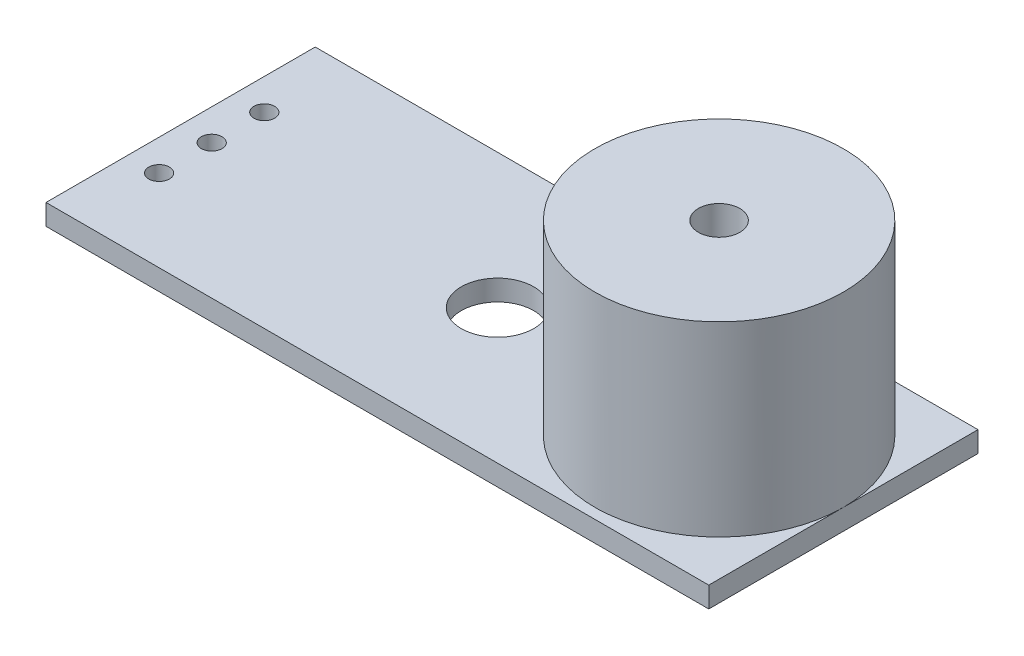
ISO-10303-21;
HEADER;
FILE_DESCRIPTION(('STEP AP214'),'2;1');
FILE_NAME('part.step','',(''),(''),'','','');
FILE_SCHEMA(('AUTOMOTIVE_DESIGN { 1 0 10303 214 1 1 1 1 }'));
ENDSEC;
DATA;
#1=APPLICATION_CONTEXT('core data for automotive mechanical design processes');
#2=APPLICATION_PROTOCOL_DEFINITION('international standard','automotive_design',2000,#1);
#3=PRODUCT_CONTEXT('',#1,'mechanical');
#4=PRODUCT('Part','Part','',(#3));
#5=PRODUCT_RELATED_PRODUCT_CATEGORY('part','',(#4));
#6=PRODUCT_DEFINITION_FORMATION('','',#4);
#7=PRODUCT_DEFINITION_CONTEXT('part definition',#1,'design');
#8=PRODUCT_DEFINITION('design','',#6,#7);
#9=PRODUCT_DEFINITION_SHAPE('','',#8);
#10=(LENGTH_UNIT() NAMED_UNIT(*) SI_UNIT(.MILLI.,.METRE.));
#11=(NAMED_UNIT(*) PLANE_ANGLE_UNIT() SI_UNIT($,.RADIAN.));
#12=(NAMED_UNIT(*) SI_UNIT($,.STERADIAN.) SOLID_ANGLE_UNIT());
#13=UNCERTAINTY_MEASURE_WITH_UNIT(LENGTH_MEASURE(1.E-05),#10,'distance_accuracy_value','');
#14=(GEOMETRIC_REPRESENTATION_CONTEXT(3) GLOBAL_UNCERTAINTY_ASSIGNED_CONTEXT((#13)) GLOBAL_UNIT_ASSIGNED_CONTEXT((#10,
#11,#12)) REPRESENTATION_CONTEXT('',''));
#15=CARTESIAN_POINT('',(0.,0.,0.));
#16=DIRECTION('',(0.,0.,1.));
#17=DIRECTION('',(1.,0.,0.));
#18=AXIS2_PLACEMENT_3D('',#15,#16,#17);
#19=CARTESIAN_POINT('',(16.,1.,-6.5));
#20=DIRECTION('',(-1.,0.,0.));
#21=DIRECTION('',(0.,0.,1.));
#22=AXIS2_PLACEMENT_3D('',#19,#20,#21);
#23=PLANE('',#22);
#24=DIRECTION('',(0.,0.,-1.));
#25=VECTOR('',#24,1.);
#26=CARTESIAN_POINT('',(16.,0.,-6.5));
#27=LINE('',#26,#25);
#28=CARTESIAN_POINT('',(16.,0.,6.5));
#29=VERTEX_POINT('',#28);
#30=CARTESIAN_POINT('',(16.,0.,-6.5));
#31=VERTEX_POINT('',#30);
#32=EDGE_CURVE('E108',#29,#31,#27,.T.);
#33=ORIENTED_EDGE('',*,*,#32,.T.);
#34=DIRECTION('',(0.,-1.,0.));
#35=VECTOR('',#34,1.);
#36=CARTESIAN_POINT('',(16.,1.,-6.5));
#37=LINE('',#36,#35);
#38=CARTESIAN_POINT('',(16.,1.,-6.5));
#39=VERTEX_POINT('',#38);
#40=EDGE_CURVE('E11',#39,#31,#37,.T.);
#41=ORIENTED_EDGE('',*,*,#40,.F.);
#42=DIRECTION('',(0.,0.,-1.));
#43=VECTOR('',#42,1.);
#44=CARTESIAN_POINT('',(16.,1.,-6.5));
#45=LINE('',#44,#43);
#46=CARTESIAN_POINT('',(16.,0.999999999999999,0.));
#47=VERTEX_POINT('',#46);
#48=EDGE_CURVE('E83',#47,#39,#45,.T.);
#49=ORIENTED_EDGE('',*,*,#48,.F.);
#50=CARTESIAN_POINT('',(16.,1.,6.5));
#51=VERTEX_POINT('',#50);
#52=EDGE_CURVE('E93',#51,#47,#45,.T.);
#53=ORIENTED_EDGE('',*,*,#52,.F.);
#54=DIRECTION('',(0.,-1.,0.));
#55=VECTOR('',#54,1.);
#56=CARTESIAN_POINT('',(16.,1.,6.5));
#57=LINE('',#56,#55);
#58=EDGE_CURVE('E104',#51,#29,#57,.T.);
#59=ORIENTED_EDGE('',*,*,#58,.T.);
#60=EDGE_LOOP('',(#33,#41,#49,#53,#59));
#61=FACE_BOUND('',#60,.T.);
#62=ADVANCED_FACE('F37',(#61),#23,.F.);
#63=CARTESIAN_POINT('',(-16.,1.,-6.5));
#64=DIRECTION('',(0.,0.,1.));
#65=DIRECTION('',(1.,0.,0.));
#66=AXIS2_PLACEMENT_3D('',#63,#64,#65);
#67=PLANE('',#66);
#68=DIRECTION('',(-1.,0.,0.));
#69=VECTOR('',#68,1.);
#70=CARTESIAN_POINT('',(-16.,0.,-6.5));
#71=LINE('',#70,#69);
#72=CARTESIAN_POINT('',(-16.,0.,-6.5));
#73=VERTEX_POINT('',#72);
#74=EDGE_CURVE('E98',#31,#73,#71,.T.);
#75=ORIENTED_EDGE('',*,*,#74,.T.);
#76=DIRECTION('',(0.,-1.,0.));
#77=VECTOR('',#76,1.);
#78=CARTESIAN_POINT('',(-16.,1.,-6.5));
#79=LINE('',#78,#77);
#80=CARTESIAN_POINT('',(-16.,1.,-6.5));
#81=VERTEX_POINT('',#80);
#82=EDGE_CURVE('E44',#81,#73,#79,.T.);
#83=ORIENTED_EDGE('',*,*,#82,.F.);
#84=DIRECTION('',(-1.,0.,0.));
#85=VECTOR('',#84,1.);
#86=CARTESIAN_POINT('',(-16.,1.,-6.5));
#87=LINE('',#86,#85);
#88=EDGE_CURVE('E85',#39,#81,#87,.T.);
#89=ORIENTED_EDGE('',*,*,#88,.F.);
#90=ORIENTED_EDGE('',*,*,#40,.T.);
#91=EDGE_LOOP('',(#75,#83,#89,#90));
#92=FACE_BOUND('',#91,.T.);
#93=ADVANCED_FACE('F96',(#92),#67,.F.);
#94=CARTESIAN_POINT('',(-16.,1.,-6.5));
#95=DIRECTION('',(1.,0.,0.));
#96=DIRECTION('',(0.,0.,-1.));
#97=AXIS2_PLACEMENT_3D('',#94,#95,#96);
#98=PLANE('',#97);
#99=DIRECTION('',(0.,0.,1.));
#100=VECTOR('',#99,1.);
#101=CARTESIAN_POINT('',(-16.,0.,-6.5));
#102=LINE('',#101,#100);
#103=CARTESIAN_POINT('',(-16.,0.,6.5));
#104=VERTEX_POINT('',#103);
#105=EDGE_CURVE('E112',#73,#104,#102,.T.);
#106=ORIENTED_EDGE('',*,*,#105,.T.);
#107=DIRECTION('',(0.,-1.,0.));
#108=VECTOR('',#107,1.);
#109=CARTESIAN_POINT('',(-16.,1.,6.5));
#110=LINE('',#109,#108);
#111=CARTESIAN_POINT('',(-16.,1.,6.5));
#112=VERTEX_POINT('',#111);
#113=EDGE_CURVE('E101',#112,#104,#110,.T.);
#114=ORIENTED_EDGE('',*,*,#113,.F.);
#115=DIRECTION('',(0.,0.,1.));
#116=VECTOR('',#115,1.);
#117=CARTESIAN_POINT('',(-16.,1.,-6.5));
#118=LINE('',#117,#116);
#119=EDGE_CURVE('E89',#81,#112,#118,.T.);
#120=ORIENTED_EDGE('',*,*,#119,.F.);
#121=ORIENTED_EDGE('',*,*,#82,.T.);
#122=EDGE_LOOP('',(#106,#114,#120,#121));
#123=FACE_BOUND('',#122,.T.);
#124=ADVANCED_FACE('F102',(#123),#98,.F.);
#125=CARTESIAN_POINT('',(-16.,1.,6.5));
#126=DIRECTION('',(0.,0.,-1.));
#127=DIRECTION('',(-1.,0.,0.));
#128=AXIS2_PLACEMENT_3D('',#125,#126,#127);
#129=PLANE('',#128);
#130=DIRECTION('',(1.,0.,0.));
#131=VECTOR('',#130,1.);
#132=CARTESIAN_POINT('',(-16.,0.,6.5));
#133=LINE('',#132,#131);
#134=EDGE_CURVE('E77',#104,#29,#133,.T.);
#135=ORIENTED_EDGE('',*,*,#134,.T.);
#136=ORIENTED_EDGE('',*,*,#58,.F.);
#137=DIRECTION('',(1.,0.,0.));
#138=VECTOR('',#137,1.);
#139=CARTESIAN_POINT('',(-16.,1.,6.5));
#140=LINE('',#139,#138);
#141=EDGE_CURVE('E57',#112,#51,#140,.T.);
#142=ORIENTED_EDGE('',*,*,#141,.F.);
#143=ORIENTED_EDGE('',*,*,#113,.T.);
#144=EDGE_LOOP('',(#135,#136,#142,#143));
#145=FACE_BOUND('',#144,.T.);
#146=ADVANCED_FACE('F116',(#145),#129,.F.);
#147=CARTESIAN_POINT('',(0.,1.,0.));
#148=DIRECTION('',(0.,1.,0.));
#149=DIRECTION('',(0.,0.,1.));
#150=AXIS2_PLACEMENT_3D('',#147,#148,#149);
#151=PLANE('',#150);
#152=CARTESIAN_POINT('',(-14.5,1.,-2.54));
#153=DIRECTION('',(0.,1.,0.));
#154=DIRECTION('',(0.,0.,1.));
#155=AXIS2_PLACEMENT_3D('',#152,#153,#154);
#156=CIRCLE('',#155,0.500000000000001);
#157=CARTESIAN_POINT('',(-14.5,1.,-2.04));
#158=VERTEX_POINT('',#157);
#159=EDGE_CURVE('E146',#158,#158,#156,.T.);
#160=ORIENTED_EDGE('',*,*,#159,.F.);
#161=EDGE_LOOP('',(#160));
#162=FACE_BOUND('',#161,.T.);
#163=CARTESIAN_POINT('',(-14.5,1.,0.));
#164=DIRECTION('',(0.,1.,0.));
#165=DIRECTION('',(0.,0.,1.));
#166=AXIS2_PLACEMENT_3D('',#163,#164,#165);
#167=CIRCLE('',#166,0.500000000000001);
#168=CARTESIAN_POINT('',(-14.5,1.,0.5));
#169=VERTEX_POINT('',#168);
#170=EDGE_CURVE('E140',#169,#169,#167,.T.);
#171=ORIENTED_EDGE('',*,*,#170,.F.);
#172=EDGE_LOOP('',(#171));
#173=FACE_BOUND('',#172,.T.);
#174=CARTESIAN_POINT('',(-14.4999999999999,1.,2.54));
#175=DIRECTION('',(0.,1.,0.));
#176=DIRECTION('',(0.,0.,1.));
#177=AXIS2_PLACEMENT_3D('',#174,#175,#176);
#178=CIRCLE('',#177,0.500000000000001);
#179=CARTESIAN_POINT('',(-14.4999999999999,1.,3.04));
#180=VERTEX_POINT('',#179);
#181=EDGE_CURVE('E133',#180,#180,#178,.T.);
#182=ORIENTED_EDGE('',*,*,#181,.F.);
#183=EDGE_LOOP('',(#182));
#184=FACE_BOUND('',#183,.T.);
#185=CARTESIAN_POINT('',(-0.699999999999999,1.,0.));
#186=DIRECTION('',(0.,1.,0.));
#187=DIRECTION('',(0.,0.,1.));
#188=AXIS2_PLACEMENT_3D('',#185,#186,#187);
#189=CIRCLE('',#188,1.75);
#190=CARTESIAN_POINT('',(-0.699999999999999,1.,1.75));
#191=VERTEX_POINT('',#190);
#192=EDGE_CURVE('E123',#191,#191,#189,.T.);
#193=ORIENTED_EDGE('',*,*,#192,.F.);
#194=EDGE_LOOP('',(#193));
#195=FACE_BOUND('',#194,.T.);
#196=ORIENTED_EDGE('',*,*,#52,.T.);
#197=CARTESIAN_POINT('',(10.,0.999999999999999,0.));
#198=DIRECTION('',(0.,1.,0.));
#199=DIRECTION('',(0.,0.,1.));
#200=AXIS2_PLACEMENT_3D('',#197,#198,#199);
#201=CIRCLE('',#200,6.);
#202=EDGE_CURVE('E49',#47,#47,#201,.F.);
#203=ORIENTED_EDGE('',*,*,#202,.T.);
#204=ORIENTED_EDGE('',*,*,#48,.T.);
#205=ORIENTED_EDGE('',*,*,#88,.T.);
#206=ORIENTED_EDGE('',*,*,#119,.T.);
#207=ORIENTED_EDGE('',*,*,#141,.T.);
#208=EDGE_LOOP('',(#196,#203,#204,#205,#206,#207));
#209=FACE_BOUND('',#208,.T.);
#210=ADVANCED_FACE('F87',(#162,#173,#184,#195,#209),#151,.T.);
#211=CARTESIAN_POINT('',(0.,0.,0.));
#212=DIRECTION('',(0.,1.,0.));
#213=DIRECTION('',(0.,0.,1.));
#214=AXIS2_PLACEMENT_3D('',#211,#212,#213);
#215=PLANE('',#214);
#216=CARTESIAN_POINT('',(-14.5,0.,-2.54));
#217=DIRECTION('',(0.,1.,0.));
#218=DIRECTION('',(0.,0.,1.));
#219=AXIS2_PLACEMENT_3D('',#216,#217,#218);
#220=CIRCLE('',#219,0.500000000000001);
#221=CARTESIAN_POINT('',(-14.5,0.,-2.04));
#222=VERTEX_POINT('',#221);
#223=EDGE_CURVE('E132',#222,#222,#220,.T.);
#224=ORIENTED_EDGE('',*,*,#223,.T.);
#225=EDGE_LOOP('',(#224));
#226=FACE_BOUND('',#225,.T.);
#227=CARTESIAN_POINT('',(-14.5,0.,0.));
#228=DIRECTION('',(0.,1.,0.));
#229=DIRECTION('',(0.,0.,1.));
#230=AXIS2_PLACEMENT_3D('',#227,#228,#229);
#231=CIRCLE('',#230,0.500000000000001);
#232=CARTESIAN_POINT('',(-14.5,0.,0.5));
#233=VERTEX_POINT('',#232);
#234=EDGE_CURVE('E143',#233,#233,#231,.T.);
#235=ORIENTED_EDGE('',*,*,#234,.T.);
#236=EDGE_LOOP('',(#235));
#237=FACE_BOUND('',#236,.T.);
#238=CARTESIAN_POINT('',(-14.4999999999999,0.,2.54));
#239=DIRECTION('',(0.,1.,0.));
#240=DIRECTION('',(0.,0.,1.));
#241=AXIS2_PLACEMENT_3D('',#238,#239,#240);
#242=CIRCLE('',#241,0.500000000000001);
#243=CARTESIAN_POINT('',(-14.4999999999999,0.,3.04));
#244=VERTEX_POINT('',#243);
#245=EDGE_CURVE('E136',#244,#244,#242,.T.);
#246=ORIENTED_EDGE('',*,*,#245,.T.);
#247=EDGE_LOOP('',(#246));
#248=FACE_BOUND('',#247,.T.);
#249=CARTESIAN_POINT('',(-0.699999999999999,0.,0.));
#250=DIRECTION('',(0.,1.,0.));
#251=DIRECTION('',(0.,0.,1.));
#252=AXIS2_PLACEMENT_3D('',#249,#250,#251);
#253=CIRCLE('',#252,1.75);
#254=CARTESIAN_POINT('',(-0.699999999999999,0.,1.75));
#255=VERTEX_POINT('',#254);
#256=EDGE_CURVE('E110',#255,#255,#253,.T.);
#257=ORIENTED_EDGE('',*,*,#256,.T.);
#258=EDGE_LOOP('',(#257));
#259=FACE_BOUND('',#258,.T.);
#260=ORIENTED_EDGE('',*,*,#74,.F.);
#261=ORIENTED_EDGE('',*,*,#32,.F.);
#262=ORIENTED_EDGE('',*,*,#134,.F.);
#263=ORIENTED_EDGE('',*,*,#105,.F.);
#264=EDGE_LOOP('',(#260,#261,#262,#263));
#265=FACE_BOUND('',#264,.T.);
#266=ADVANCED_FACE('F119',(#226,#237,#248,#259,#265),#215,.F.);
#267=CARTESIAN_POINT('',(-0.699999999999999,0.,0.));
#268=DIRECTION('',(0.,1.,0.));
#269=DIRECTION('',(0.,0.,1.));
#270=AXIS2_PLACEMENT_3D('',#267,#268,#269);
#271=CYLINDRICAL_SURFACE('',#270,1.75);
#272=ORIENTED_EDGE('',*,*,#256,.F.);
#273=EDGE_LOOP('',(#272));
#274=FACE_BOUND('',#273,.T.);
#275=ORIENTED_EDGE('',*,*,#192,.T.);
#276=EDGE_LOOP('',(#275));
#277=FACE_BOUND('',#276,.T.);
#278=ADVANCED_FACE('F175',(#274,#277),#271,.F.);
#279=CARTESIAN_POINT('',(10.,10.,0.));
#280=DIRECTION('',(0.,-1.,0.));
#281=DIRECTION('',(0.,0.,-1.));
#282=AXIS2_PLACEMENT_3D('',#279,#280,#281);
#283=CYLINDRICAL_SURFACE('',#282,6.);
#284=ORIENTED_EDGE('',*,*,#202,.F.);
#285=EDGE_LOOP('',(#284));
#286=FACE_BOUND('',#285,.T.);
#287=CARTESIAN_POINT('',(10.,10.,0.));
#288=DIRECTION('',(0.,1.,0.));
#289=DIRECTION('',(0.,0.,1.));
#290=AXIS2_PLACEMENT_3D('',#287,#288,#289);
#291=CIRCLE('',#290,6.);
#292=CARTESIAN_POINT('',(10.,10.,6.));
#293=VERTEX_POINT('',#292);
#294=EDGE_CURVE('E129',#293,#293,#291,.T.);
#295=ORIENTED_EDGE('',*,*,#294,.F.);
#296=EDGE_LOOP('',(#295));
#297=FACE_BOUND('',#296,.T.);
#298=ADVANCED_FACE('F170',(#286,#297),#283,.T.);
#299=CARTESIAN_POINT('',(10.,10.,0.));
#300=DIRECTION('',(0.,1.,0.));
#301=DIRECTION('',(0.,0.,1.));
#302=AXIS2_PLACEMENT_3D('',#299,#300,#301);
#303=PLANE('',#302);
#304=CARTESIAN_POINT('',(10.,10.,0.));
#305=DIRECTION('',(0.,1.,0.));
#306=DIRECTION('',(0.,0.,1.));
#307=AXIS2_PLACEMENT_3D('',#304,#305,#306);
#308=CIRCLE('',#307,1.);
#309=CARTESIAN_POINT('',(10.,10.,1.));
#310=VERTEX_POINT('',#309);
#311=EDGE_CURVE('E151',#310,#310,#308,.T.);
#312=ORIENTED_EDGE('',*,*,#311,.F.);
#313=EDGE_LOOP('',(#312));
#314=FACE_BOUND('',#313,.T.);
#315=ORIENTED_EDGE('',*,*,#294,.T.);
#316=EDGE_LOOP('',(#315));
#317=FACE_BOUND('',#316,.T.);
#318=ADVANCED_FACE('F166',(#314,#317),#303,.T.);
#319=CARTESIAN_POINT('',(-14.4999999999999,0.,2.54));
#320=DIRECTION('',(0.,1.,0.));
#321=DIRECTION('',(0.,0.,1.));
#322=AXIS2_PLACEMENT_3D('',#319,#320,#321);
#323=CYLINDRICAL_SURFACE('',#322,0.500000000000001);
#324=ORIENTED_EDGE('',*,*,#245,.F.);
#325=EDGE_LOOP('',(#324));
#326=FACE_BOUND('',#325,.T.);
#327=ORIENTED_EDGE('',*,*,#181,.T.);
#328=EDGE_LOOP('',(#327));
#329=FACE_BOUND('',#328,.T.);
#330=ADVANCED_FACE('F169',(#326,#329),#323,.F.);
#331=CARTESIAN_POINT('',(-14.5,0.,0.));
#332=DIRECTION('',(0.,1.,0.));
#333=DIRECTION('',(0.,0.,1.));
#334=AXIS2_PLACEMENT_3D('',#331,#332,#333);
#335=CYLINDRICAL_SURFACE('',#334,0.500000000000001);
#336=ORIENTED_EDGE('',*,*,#234,.F.);
#337=EDGE_LOOP('',(#336));
#338=FACE_BOUND('',#337,.T.);
#339=ORIENTED_EDGE('',*,*,#170,.T.);
#340=EDGE_LOOP('',(#339));
#341=FACE_BOUND('',#340,.T.);
#342=ADVANCED_FACE('F210',(#338,#341),#335,.F.);
#343=CARTESIAN_POINT('',(-14.5,0.,-2.54));
#344=DIRECTION('',(0.,1.,0.));
#345=DIRECTION('',(0.,0.,1.));
#346=AXIS2_PLACEMENT_3D('',#343,#344,#345);
#347=CYLINDRICAL_SURFACE('',#346,0.500000000000001);
#348=ORIENTED_EDGE('',*,*,#223,.F.);
#349=EDGE_LOOP('',(#348));
#350=FACE_BOUND('',#349,.T.);
#351=ORIENTED_EDGE('',*,*,#159,.T.);
#352=EDGE_LOOP('',(#351));
#353=FACE_BOUND('',#352,.T.);
#354=ADVANCED_FACE('F162',(#350,#353),#347,.F.);
#355=CARTESIAN_POINT('',(10.,8.,0.));
#356=DIRECTION('',(0.,1.,0.));
#357=DIRECTION('',(0.,0.,1.));
#358=AXIS2_PLACEMENT_3D('',#355,#356,#357);
#359=CYLINDRICAL_SURFACE('',#358,1.);
#360=CARTESIAN_POINT('',(10.,8.,0.));
#361=DIRECTION('',(0.,1.,0.));
#362=DIRECTION('',(0.,0.,1.));
#363=AXIS2_PLACEMENT_3D('',#360,#361,#362);
#364=CIRCLE('',#363,1.);
#365=CARTESIAN_POINT('',(10.,8.,1.));
#366=VERTEX_POINT('',#365);
#367=EDGE_CURVE('E137',#366,#366,#364,.T.);
#368=ORIENTED_EDGE('',*,*,#367,.F.);
#369=EDGE_LOOP('',(#368));
#370=FACE_BOUND('',#369,.T.);
#371=ORIENTED_EDGE('',*,*,#311,.T.);
#372=EDGE_LOOP('',(#371));
#373=FACE_BOUND('',#372,.T.);
#374=ADVANCED_FACE('F159',(#370,#373),#359,.F.);
#375=CARTESIAN_POINT('',(10.,8.,0.));
#376=DIRECTION('',(0.,1.,0.));
#377=DIRECTION('',(0.,0.,1.));
#378=AXIS2_PLACEMENT_3D('',#375,#376,#377);
#379=PLANE('',#378);
#380=ORIENTED_EDGE('',*,*,#367,.T.);
#381=EDGE_LOOP('',(#380));
#382=FACE_BOUND('',#381,.T.);
#383=ADVANCED_FACE('F157',(#382),#379,.T.);
#384=CLOSED_SHELL('',(#62,#93,#124,#146,#210,#266,#278,#298,#318,#330,#342,#354,#374,#383));
#385=MANIFOLD_SOLID_BREP('B2',#384);
#386=ADVANCED_BREP_SHAPE_REPRESENTATION('',(#18,#385),#14);
#387=SHAPE_DEFINITION_REPRESENTATION(#9,#386);
ENDSEC;
END-ISO-10303-21;
